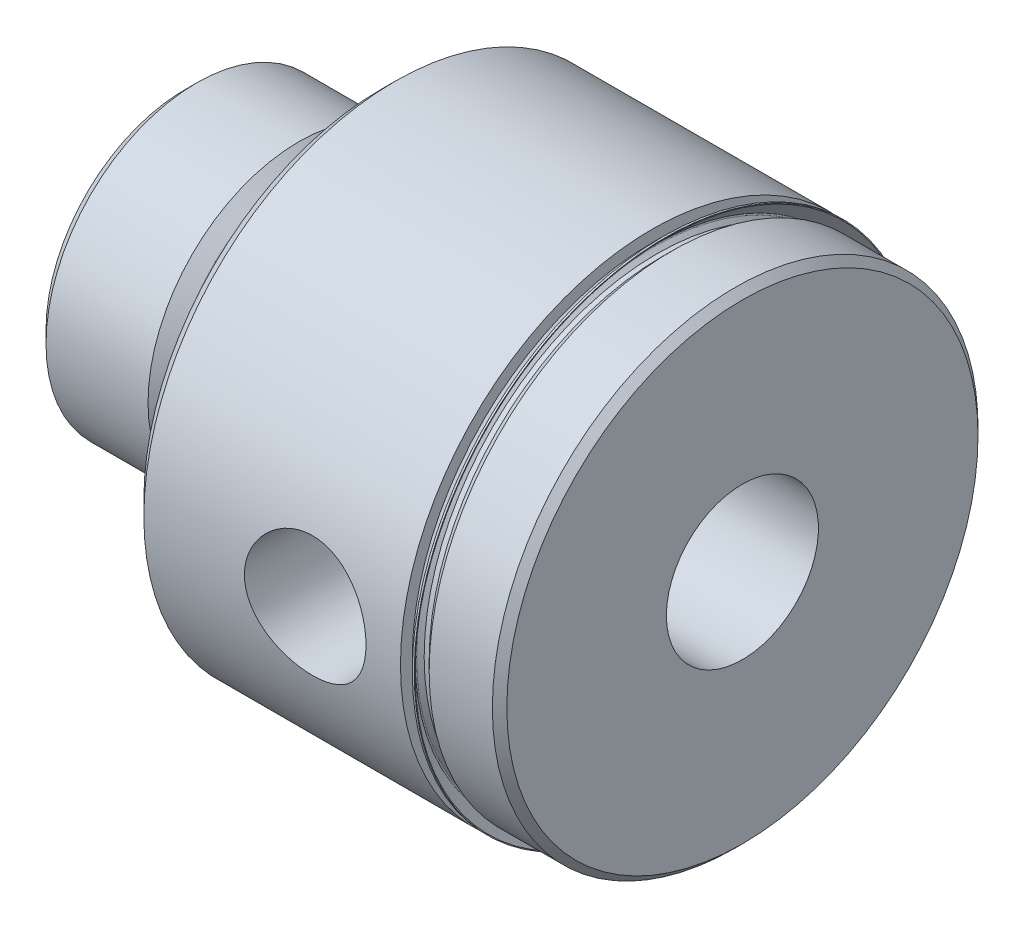
ISO-10303-21;
HEADER;
FILE_DESCRIPTION(('STEP AP214'),'2;1');
FILE_NAME('part.step','',(''),(''),'','','');
FILE_SCHEMA(('AUTOMOTIVE_DESIGN { 1 0 10303 214 1 1 1 1 }'));
ENDSEC;
DATA;
#1=APPLICATION_CONTEXT('core data for automotive mechanical design processes');
#2=APPLICATION_PROTOCOL_DEFINITION('international standard','automotive_design',2000,#1);
#3=PRODUCT_CONTEXT('',#1,'mechanical');
#4=PRODUCT('Part','Part','',(#3));
#5=PRODUCT_RELATED_PRODUCT_CATEGORY('part','',(#4));
#6=PRODUCT_DEFINITION_FORMATION('','',#4);
#7=PRODUCT_DEFINITION_CONTEXT('part definition',#1,'design');
#8=PRODUCT_DEFINITION('design','',#6,#7);
#9=PRODUCT_DEFINITION_SHAPE('','',#8);
#10=(LENGTH_UNIT() NAMED_UNIT(*) SI_UNIT(.MILLI.,.METRE.));
#11=(NAMED_UNIT(*) PLANE_ANGLE_UNIT() SI_UNIT($,.RADIAN.));
#12=(NAMED_UNIT(*) SI_UNIT($,.STERADIAN.) SOLID_ANGLE_UNIT());
#13=UNCERTAINTY_MEASURE_WITH_UNIT(LENGTH_MEASURE(1.E-05),#10,'distance_accuracy_value','');
#14=(GEOMETRIC_REPRESENTATION_CONTEXT(3) GLOBAL_UNCERTAINTY_ASSIGNED_CONTEXT((#13)) GLOBAL_UNIT_ASSIGNED_CONTEXT((#10,
#11,#12)) REPRESENTATION_CONTEXT('',''));
#15=CARTESIAN_POINT('',(0.,0.,0.));
#16=DIRECTION('',(0.,0.,1.));
#17=DIRECTION('',(1.,0.,0.));
#18=AXIS2_PLACEMENT_3D('',#15,#16,#17);
#19=CARTESIAN_POINT('',(58.7248,0.,0.));
#20=DIRECTION('',(-1.,0.,0.));
#21=DIRECTION('',(0.,0.,1.));
#22=AXIS2_PLACEMENT_3D('',#19,#20,#21);
#23=CYLINDRICAL_SURFACE('',#22,24.51735);
#24=CARTESIAN_POINT('',(49.7268500000003,5.32973665201554E-13,0.));
#25=DIRECTION('',(-1.,0.,0.));
#26=DIRECTION('',(0.,-1.,0.));
#27=AXIS2_PLACEMENT_3D('',#24,#25,#26);
#28=CIRCLE('',#27,24.5173499999995);
#29=CARTESIAN_POINT('',(49.7268500000005,-24.5173499999989,0.));
#30=VERTEX_POINT('',#29);
#31=EDGE_CURVE('E194',#30,#30,#28,.T.);
#32=ORIENTED_EDGE('',*,*,#31,.F.);
#33=EDGE_LOOP('',(#32));
#34=FACE_BOUND('',#33,.T.);
#35=CARTESIAN_POINT('',(50.2539,0.,0.));
#36=DIRECTION('',(1.,0.,0.));
#37=DIRECTION('',(0.,0.,-1.));
#38=AXIS2_PLACEMENT_3D('',#35,#36,#37);
#39=CIRCLE('',#38,24.51735);
#40=CARTESIAN_POINT('',(50.2539,0.,-24.51735));
#41=VERTEX_POINT('',#40);
#42=EDGE_CURVE('E204',#41,#41,#39,.T.);
#43=ORIENTED_EDGE('',*,*,#42,.F.);
#44=EDGE_LOOP('',(#43));
#45=FACE_BOUND('',#44,.T.);
#46=ADVANCED_FACE('F15',(#34,#45),#23,.T.);
#47=CARTESIAN_POINT('',(12.0069923389245,0.,0.));
#48=DIRECTION('',(-1.,0.,0.));
#49=DIRECTION('',(0.,0.,1.));
#50=AXIS2_PLACEMENT_3D('',#47,#48,#49);
#51=CONICAL_SURFACE('',#50,15.875,0.768428877685454);
#52=CARTESIAN_POINT('',(12.0069923389245,0.,0.));
#53=DIRECTION('',(-1.,0.,0.));
#54=DIRECTION('',(0.,0.,1.));
#55=AXIS2_PLACEMENT_3D('',#52,#53,#54);
#56=CIRCLE('',#55,15.875);
#57=CARTESIAN_POINT('',(12.0069923389245,0.,15.875));
#58=VERTEX_POINT('',#57);
#59=EDGE_CURVE('E199',#58,#58,#56,.T.);
#60=ORIENTED_EDGE('',*,*,#59,.F.);
#61=EDGE_LOOP('',(#60));
#62=FACE_BOUND('',#61,.T.);
#63=CARTESIAN_POINT('',(13.2834291470904,0.,0.));
#64=DIRECTION('',(1.,0.,0.));
#65=DIRECTION('',(0.,0.,-1.));
#66=AXIS2_PLACEMENT_3D('',#63,#64,#65);
#67=CIRCLE('',#66,14.641164803907);
#68=CARTESIAN_POINT('',(13.2834291470904,0.,-14.641164803907));
#69=VERTEX_POINT('',#68);
#70=EDGE_CURVE('E190',#69,#69,#67,.F.);
#71=ORIENTED_EDGE('',*,*,#70,.T.);
#72=EDGE_LOOP('',(#71));
#73=FACE_BOUND('',#72,.T.);
#74=ADVANCED_FACE('F213',(#62,#73),#51,.T.);
#75=CARTESIAN_POINT('',(51.308,0.,0.));
#76=DIRECTION('',(1.,0.,0.));
#77=DIRECTION('',(0.,1.,0.));
#78=AXIS2_PLACEMENT_3D('',#75,#76,#77);
#79=CONICAL_SURFACE('',#78,25.57145,0.785398163397448);
#80=ORIENTED_EDGE('',*,*,#42,.T.);
#81=EDGE_LOOP('',(#80));
#82=FACE_BOUND('',#81,.T.);
#83=CARTESIAN_POINT('',(51.308,0.,0.));
#84=DIRECTION('',(-1.,0.,0.));
#85=DIRECTION('',(0.,0.,1.));
#86=AXIS2_PLACEMENT_3D('',#83,#84,#85);
#87=CIRCLE('',#86,25.57145);
#88=CARTESIAN_POINT('',(51.308,0.,25.57145));
#89=VERTEX_POINT('',#88);
#90=EDGE_CURVE('E193',#89,#89,#87,.F.);
#91=ORIENTED_EDGE('',*,*,#90,.F.);
#92=EDGE_LOOP('',(#91));
#93=FACE_BOUND('',#92,.T.);
#94=ADVANCED_FACE('F209',(#82,#93),#79,.T.);
#95=CARTESIAN_POINT('',(20.6502,0.,0.));
#96=DIRECTION('',(-1.,0.,0.));
#97=DIRECTION('',(0.,0.,1.));
#98=AXIS2_PLACEMENT_3D('',#95,#96,#97);
#99=CYLINDRICAL_SURFACE('',#98,15.875);
#100=CARTESIAN_POINT('',(1.25984,0.,0.));
#101=DIRECTION('',(1.,0.,0.));
#102=DIRECTION('',(0.,0.,-1.));
#103=AXIS2_PLACEMENT_3D('',#100,#101,#102);
#104=CIRCLE('',#103,15.875);
#105=CARTESIAN_POINT('',(1.25984,0.,-15.875));
#106=VERTEX_POINT('',#105);
#107=EDGE_CURVE('E227',#106,#106,#104,.F.);
#108=ORIENTED_EDGE('',*,*,#107,.F.);
#109=EDGE_LOOP('',(#108));
#110=FACE_BOUND('',#109,.T.);
#111=ORIENTED_EDGE('',*,*,#59,.T.);
#112=EDGE_LOOP('',(#111));
#113=FACE_BOUND('',#112,.T.);
#114=ADVANCED_FACE('F223',(#110,#113),#99,.T.);
#115=CARTESIAN_POINT('',(49.3348163031622,5.27355936696949E-13,0.));
#116=DIRECTION('',(-1.,0.,0.));
#117=DIRECTION('',(0.,-1.,0.));
#118=AXIS2_PLACEMENT_3D('',#115,#116,#117);
#119=CONICAL_SURFACE('',#118,24.9093836968375,0.785398163397439);
#120=ORIENTED_EDGE('',*,*,#31,.T.);
#121=EDGE_LOOP('',(#120));
#122=FACE_BOUND('',#121,.T.);
#123=CARTESIAN_POINT('',(49.3348163031621,5.26394964445129E-13,0.));
#124=DIRECTION('',(1.,0.,0.));
#125=DIRECTION('',(0.,1.,0.));
#126=AXIS2_PLACEMENT_3D('',#123,#124,#125);
#127=CIRCLE('',#126,24.9093836968375);
#128=CARTESIAN_POINT('',(49.3348163031619,24.909383696838,0.));
#129=VERTEX_POINT('',#128);
#130=EDGE_CURVE('E156',#129,#129,#127,.T.);
#131=ORIENTED_EDGE('',*,*,#130,.T.);
#132=EDGE_LOOP('',(#131));
#133=FACE_BOUND('',#132,.T.);
#134=ADVANCED_FACE('F182',(#122,#133),#119,.T.);
#135=CARTESIAN_POINT('',(14.2367,0.,0.));
#136=DIRECTION('',(1.,0.,0.));
#137=DIRECTION('',(0.,0.,-1.));
#138=AXIS2_PLACEMENT_3D('',#135,#136,#137);
#139=TOROIDAL_SURFACE('',#138,15.62735,1.37160000000001);
#140=ORIENTED_EDGE('',*,*,#70,.F.);
#141=EDGE_LOOP('',(#140));
#142=FACE_BOUND('',#141,.T.);
#143=CARTESIAN_POINT('',(14.2367,0.,0.));
#144=DIRECTION('',(-1.,0.,0.));
#145=DIRECTION('',(0.,0.,1.));
#146=AXIS2_PLACEMENT_3D('',#143,#144,#145);
#147=CIRCLE('',#146,14.25575);
#148=CARTESIAN_POINT('',(14.2367,0.,14.25575));
#149=VERTEX_POINT('',#148);
#150=EDGE_CURVE('E151',#149,#149,#147,.F.);
#151=ORIENTED_EDGE('',*,*,#150,.F.);
#152=EDGE_LOOP('',(#151));
#153=FACE_BOUND('',#152,.T.);
#154=ADVANCED_FACE('F177',(#142,#153),#139,.F.);
#155=CARTESIAN_POINT('',(58.7248,0.,0.));
#156=DIRECTION('',(-1.,0.,0.));
#157=DIRECTION('',(0.,0.,1.));
#158=AXIS2_PLACEMENT_3D('',#155,#156,#157);
#159=CYLINDRICAL_SURFACE('',#158,25.57145);
#160=ORIENTED_EDGE('',*,*,#90,.T.);
#161=EDGE_LOOP('',(#160));
#162=FACE_BOUND('',#161,.T.);
#163=CARTESIAN_POINT('',(57.9628,0.,0.));
#164=DIRECTION('',(-1.,0.,0.));
#165=DIRECTION('',(0.,0.,1.));
#166=AXIS2_PLACEMENT_3D('',#163,#164,#165);
#167=CIRCLE('',#166,25.57145);
#168=CARTESIAN_POINT('',(57.9628,0.,25.57145));
#169=VERTEX_POINT('',#168);
#170=EDGE_CURVE('E148',#169,#169,#167,.F.);
#171=ORIENTED_EDGE('',*,*,#170,.F.);
#172=EDGE_LOOP('',(#171));
#173=FACE_BOUND('',#172,.T.);
#174=ADVANCED_FACE('F173',(#162,#173),#159,.T.);
#175=CARTESIAN_POINT('',(1.25984,0.,0.));
#176=DIRECTION('',(1.,0.,0.));
#177=DIRECTION('',(0.,0.,-1.));
#178=AXIS2_PLACEMENT_3D('',#175,#176,#177);
#179=CONICAL_SURFACE('',#178,15.875,0.785398163397449);
#180=CARTESIAN_POINT('',(0.,0.,0.));
#181=DIRECTION('',(1.,0.,0.));
#182=DIRECTION('',(0.,0.,-1.));
#183=AXIS2_PLACEMENT_3D('',#180,#181,#182);
#184=CIRCLE('',#183,14.61516);
#185=CARTESIAN_POINT('',(0.,0.,-14.61516));
#186=VERTEX_POINT('',#185);
#187=EDGE_CURVE('E18',#186,#186,#184,.T.);
#188=ORIENTED_EDGE('',*,*,#187,.T.);
#189=EDGE_LOOP('',(#188));
#190=FACE_BOUND('',#189,.T.);
#191=ORIENTED_EDGE('',*,*,#107,.T.);
#192=EDGE_LOOP('',(#191));
#193=FACE_BOUND('',#192,.T.);
#194=ADVANCED_FACE('F168',(#190,#193),#179,.T.);
#195=CARTESIAN_POINT('',(49.4246188643728,5.27355936696949E-13,0.));
#196=DIRECTION('',(1.,0.,0.));
#197=DIRECTION('',(0.,1.,0.));
#198=AXIS2_PLACEMENT_3D('',#195,#196,#197);
#199=TOROIDAL_SURFACE('',#198,24.9991862580482,0.127000000000001);
#200=CARTESIAN_POINT('',(49.3348163031622,5.28778534245808E-13,0.));
#201=DIRECTION('',(1.,0.,0.));
#202=DIRECTION('',(0.,1.,0.));
#203=AXIS2_PLACEMENT_3D('',#200,#201,#202);
#204=CIRCLE('',#203,25.0889888192589);
#205=CARTESIAN_POINT('',(49.3348163031619,25.0889888192594,0.));
#206=VERTEX_POINT('',#205);
#207=EDGE_CURVE('E137',#206,#206,#204,.T.);
#208=ORIENTED_EDGE('',*,*,#207,.T.);
#209=EDGE_LOOP('',(#208));
#210=FACE_BOUND('',#209,.T.);
#211=ORIENTED_EDGE('',*,*,#130,.F.);
#212=EDGE_LOOP('',(#211));
#213=FACE_BOUND('',#212,.T.);
#214=ADVANCED_FACE('F163',(#210,#213),#199,.F.);
#215=CARTESIAN_POINT('',(20.6502,0.,0.));
#216=DIRECTION('',(-1.,0.,0.));
#217=DIRECTION('',(0.,0.,1.));
#218=AXIS2_PLACEMENT_3D('',#215,#216,#217);
#219=CYLINDRICAL_SURFACE('',#218,14.25575);
#220=ORIENTED_EDGE('',*,*,#150,.T.);
#221=EDGE_LOOP('',(#220));
#222=FACE_BOUND('',#221,.T.);
#223=CARTESIAN_POINT('',(16.1036,0.,0.));
#224=DIRECTION('',(1.,0.,0.));
#225=DIRECTION('',(0.,0.,-1.));
#226=AXIS2_PLACEMENT_3D('',#223,#224,#225);
#227=CIRCLE('',#226,14.25575);
#228=CARTESIAN_POINT('',(16.1036,0.,-14.25575));
#229=VERTEX_POINT('',#228);
#230=EDGE_CURVE('E145',#229,#229,#227,.F.);
#231=ORIENTED_EDGE('',*,*,#230,.T.);
#232=EDGE_LOOP('',(#231));
#233=FACE_BOUND('',#232,.T.);
#234=ADVANCED_FACE('F167',(#222,#233),#219,.T.);
#235=CARTESIAN_POINT('',(57.9628,0.,0.));
#236=DIRECTION('',(-1.,0.,0.));
#237=DIRECTION('',(0.,-1.,0.));
#238=AXIS2_PLACEMENT_3D('',#235,#236,#237);
#239=CONICAL_SURFACE('',#238,25.57145,0.785398163397455);
#240=ORIENTED_EDGE('',*,*,#170,.T.);
#241=EDGE_LOOP('',(#240));
#242=FACE_BOUND('',#241,.T.);
#243=CARTESIAN_POINT('',(58.7248,0.,0.));
#244=DIRECTION('',(-1.,0.,0.));
#245=DIRECTION('',(0.,-1.,0.));
#246=AXIS2_PLACEMENT_3D('',#243,#244,#245);
#247=CIRCLE('',#246,24.80945);
#248=CARTESIAN_POINT('',(58.7248,-24.80945,0.));
#249=VERTEX_POINT('',#248);
#250=EDGE_CURVE('E258',#249,#249,#247,.T.);
#251=ORIENTED_EDGE('',*,*,#250,.T.);
#252=EDGE_LOOP('',(#251));
#253=FACE_BOUND('',#252,.T.);
#254=ADVANCED_FACE('F255',(#242,#253),#239,.T.);
#255=CARTESIAN_POINT('',(0.,0.,0.));
#256=DIRECTION('',(1.,0.,0.));
#257=DIRECTION('',(0.,0.,-1.));
#258=AXIS2_PLACEMENT_3D('',#255,#256,#257);
#259=PLANE('',#258);
#260=CARTESIAN_POINT('',(0.,0.,0.));
#261=DIRECTION('',(-1.,0.,0.));
#262=DIRECTION('',(0.,-1.,0.));
#263=AXIS2_PLACEMENT_3D('',#260,#261,#262);
#264=CIRCLE('',#263,8.76935);
#265=CARTESIAN_POINT('',(0.,-8.76935,0.));
#266=VERTEX_POINT('',#265);
#267=EDGE_CURVE('E260',#266,#266,#264,.F.);
#268=ORIENTED_EDGE('',*,*,#267,.T.);
#269=EDGE_LOOP('',(#268));
#270=FACE_BOUND('',#269,.T.);
#271=ORIENTED_EDGE('',*,*,#187,.F.);
#272=EDGE_LOOP('',(#271));
#273=FACE_BOUND('',#272,.T.);
#274=ADVANCED_FACE('F449',(#270,#273),#259,.F.);
#275=CARTESIAN_POINT('',(50.6475092880286,5.41233724504764E-13,0.));
#276=DIRECTION('',(1.,0.,0.));
#277=DIRECTION('',(0.,1.,0.));
#278=AXIS2_PLACEMENT_3D('',#275,#276,#277);
#279=CONICAL_SURFACE('',#278,26.4016818041253,0.785398163397442);
#280=ORIENTED_EDGE('',*,*,#207,.F.);
#281=EDGE_LOOP('',(#280));
#282=FACE_BOUND('',#281,.T.);
#283=CARTESIAN_POINT('',(50.6475092880286,5.41233724504764E-13,0.));
#284=DIRECTION('',(1.,0.,0.));
#285=DIRECTION('',(0.,1.,0.));
#286=AXIS2_PLACEMENT_3D('',#283,#284,#285);
#287=CIRCLE('',#286,26.4016818041253);
#288=CARTESIAN_POINT('',(50.6475092880283,26.4016818041259,0.));
#289=VERTEX_POINT('',#288);
#290=EDGE_CURVE('E265',#289,#289,#287,.F.);
#291=ORIENTED_EDGE('',*,*,#290,.F.);
#292=EDGE_LOOP('',(#291));
#293=FACE_BOUND('',#292,.T.);
#294=ADVANCED_FACE('F128',(#282,#293),#279,.F.);
#295=CARTESIAN_POINT('',(16.1036,0.,0.));
#296=DIRECTION('',(1.,0.,0.));
#297=DIRECTION('',(0.,0.,-1.));
#298=AXIS2_PLACEMENT_3D('',#295,#296,#297);
#299=TOROIDAL_SURFACE('',#298,15.62735,1.37159999999999);
#300=ORIENTED_EDGE('',*,*,#230,.F.);
#301=EDGE_LOOP('',(#300));
#302=FACE_BOUND('',#301,.T.);
#303=CARTESIAN_POINT('',(17.4752,0.,0.));
#304=DIRECTION('',(-1.,0.,0.));
#305=DIRECTION('',(0.,0.,-1.));
#306=AXIS2_PLACEMENT_3D('',#303,#304,#305);
#307=CIRCLE('',#306,15.62735);
#308=CARTESIAN_POINT('',(17.4752,0.,-15.62735));
#309=VERTEX_POINT('',#308);
#310=EDGE_CURVE('E92',#309,#309,#307,.T.);
#311=ORIENTED_EDGE('',*,*,#310,.T.);
#312=EDGE_LOOP('',(#311));
#313=FACE_BOUND('',#312,.T.);
#314=ADVANCED_FACE('F123',(#302,#313),#299,.F.);
#315=CARTESIAN_POINT('',(58.7248,24.80945,0.));
#316=DIRECTION('',(-1.,0.,0.));
#317=DIRECTION('',(0.,0.,1.));
#318=AXIS2_PLACEMENT_3D('',#315,#316,#317);
#319=PLANE('',#318);
#320=ORIENTED_EDGE('',*,*,#250,.F.);
#321=EDGE_LOOP('',(#320));
#322=FACE_BOUND('',#321,.T.);
#323=CARTESIAN_POINT('',(58.7248,0.,0.));
#324=DIRECTION('',(-1.,0.,0.));
#325=DIRECTION('',(0.,0.,1.));
#326=AXIS2_PLACEMENT_3D('',#323,#324,#325);
#327=CIRCLE('',#326,8.00735);
#328=CARTESIAN_POINT('',(58.7248,0.,8.00735));
#329=VERTEX_POINT('',#328);
#330=EDGE_CURVE('E85',#329,#329,#327,.T.);
#331=ORIENTED_EDGE('',*,*,#330,.T.);
#332=EDGE_LOOP('',(#331));
#333=FACE_BOUND('',#332,.T.);
#334=ADVANCED_FACE('F119',(#322,#333),#319,.F.);
#335=CARTESIAN_POINT('',(0.,0.,0.));
#336=DIRECTION('',(-1.,0.,0.));
#337=DIRECTION('',(0.,-1.,0.));
#338=AXIS2_PLACEMENT_3D('',#335,#336,#337);
#339=CONICAL_SURFACE('',#338,8.76935,0.785398163397453);
#340=ORIENTED_EDGE('',*,*,#267,.F.);
#341=EDGE_LOOP('',(#340));
#342=FACE_BOUND('',#341,.T.);
#343=CARTESIAN_POINT('',(0.761999999999992,0.,0.));
#344=DIRECTION('',(-1.,0.,0.));
#345=DIRECTION('',(0.,0.,1.));
#346=AXIS2_PLACEMENT_3D('',#343,#344,#345);
#347=CIRCLE('',#346,8.00735);
#348=CARTESIAN_POINT('',(0.761999999999992,0.,8.00735));
#349=VERTEX_POINT('',#348);
#350=EDGE_CURVE('E81',#349,#349,#347,.F.);
#351=ORIENTED_EDGE('',*,*,#350,.T.);
#352=EDGE_LOOP('',(#351));
#353=FACE_BOUND('',#352,.T.);
#354=ADVANCED_FACE('F115',(#342,#353),#339,.F.);
#355=CARTESIAN_POINT('',(50.6475092880283,26.4016818041259,0.));
#356=DIRECTION('',(1.,0.,0.));
#357=DIRECTION('',(0.,1.,0.));
#358=AXIS2_PLACEMENT_3D('',#355,#356,#357);
#359=PLANE('',#358);
#360=ORIENTED_EDGE('',*,*,#290,.T.);
#361=EDGE_LOOP('',(#360));
#362=FACE_BOUND('',#361,.T.);
#363=CARTESIAN_POINT('',(50.6475092880285,5.42825589436772E-13,0.));
#364=DIRECTION('',(-1.,0.,0.));
#365=DIRECTION('',(0.,-1.,0.));
#366=AXIS2_PLACEMENT_3D('',#363,#364,#365);
#367=CIRCLE('',#366,26.4858499999995);
#368=CARTESIAN_POINT('',(50.6475092880288,-26.485849999999,0.));
#369=VERTEX_POINT('',#368);
#370=EDGE_CURVE('E84',#369,#369,#367,.T.);
#371=ORIENTED_EDGE('',*,*,#370,.F.);
#372=EDGE_LOOP('',(#371));
#373=FACE_BOUND('',#372,.T.);
#374=ADVANCED_FACE('F110',(#362,#373),#359,.T.);
#375=CARTESIAN_POINT('',(17.4752,15.62735,0.));
#376=DIRECTION('',(1.,0.,0.));
#377=DIRECTION('',(0.,0.,-1.));
#378=AXIS2_PLACEMENT_3D('',#375,#376,#377);
#379=PLANE('',#378);
#380=ORIENTED_EDGE('',*,*,#310,.F.);
#381=EDGE_LOOP('',(#380));
#382=FACE_BOUND('',#381,.T.);
#383=CARTESIAN_POINT('',(17.4752,0.,0.));
#384=DIRECTION('',(-1.,0.,0.));
#385=DIRECTION('',(0.,0.,1.));
#386=AXIS2_PLACEMENT_3D('',#383,#384,#385);
#387=CIRCLE('',#386,17.44345);
#388=CARTESIAN_POINT('',(17.4752,0.,17.44345));
#389=VERTEX_POINT('',#388);
#390=EDGE_CURVE('E274',#389,#389,#387,.F.);
#391=ORIENTED_EDGE('',*,*,#390,.F.);
#392=EDGE_LOOP('',(#391));
#393=FACE_BOUND('',#392,.T.);
#394=ADVANCED_FACE('F99',(#382,#393),#379,.F.);
#395=CARTESIAN_POINT('',(58.7248,0.,0.));
#396=DIRECTION('',(-1.,0.,0.));
#397=DIRECTION('',(0.,0.,1.));
#398=AXIS2_PLACEMENT_3D('',#395,#396,#397);
#399=CYLINDRICAL_SURFACE('',#398,8.00735);
#400=CARTESIAN_POINT('',(42.3378655226703,0.158017197130625,8.00579084592487));
#401=CARTESIAN_POINT('',(42.3292699302208,0.33027309450608,8.00238188699772));
#402=CARTESIAN_POINT('',(42.3065908282713,0.501872250772665,7.99338265716794));
#403=CARTESIAN_POINT('',(42.2340034917107,0.838173081918166,7.96515407303224));
#404=CARTESIAN_POINT('',(42.1840996319257,1.0028758604188,7.94592636238326));
#405=CARTESIAN_POINT('',(42.0591081841969,1.32070664030766,7.89931205695732));
#406=CARTESIAN_POINT('',(41.9840792403693,1.47386058710112,7.87194447781742));
#407=CARTESIAN_POINT('',(41.8111444880152,1.76545512238576,7.8117237745685));
#408=CARTESIAN_POINT('',(41.7132319890959,1.90389139066154,7.77886904700253));
#409=CARTESIAN_POINT('',(41.4921453888799,2.1689875395559,7.70926546452569));
#410=CARTESIAN_POINT('',(41.368031772196,2.29483565116167,7.67240784692046));
#411=CARTESIAN_POINT('',(41.1004324130262,2.52443796381659,7.5999599439646));
#412=CARTESIAN_POINT('',(40.9569409535404,2.62818562125,7.56437003655446));
#413=CARTESIAN_POINT('',(40.6489956382672,2.81372057364353,7.49737900591169));
#414=CARTESIAN_POINT('',(40.4840245201568,2.89471478253851,7.46614478040125));
#415=CARTESIAN_POINT('',(40.1412382677191,3.02734412643813,7.41336577267898));
#416=CARTESIAN_POINT('',(39.9634308705127,3.07899678338204,7.39181520927027));
#417=CARTESIAN_POINT('',(39.6109037003996,3.14861837102262,7.36241906210748));
#418=CARTESIAN_POINT('',(39.4365931875234,3.1683516164685,7.35385739076448));
#419=CARTESIAN_POINT('',(39.0869685160204,3.17880637486327,7.34934639318704));
#420=CARTESIAN_POINT('',(38.9116547124676,3.16953758617001,7.35339285075864));
#421=CARTESIAN_POINT('',(38.5758337062393,3.12384751148693,7.37290769419972));
#422=CARTESIAN_POINT('',(38.4150608137759,3.08904897611976,7.38769295000463));
#423=CARTESIAN_POINT('',(38.1017671556934,2.99550847654387,7.42611063735));
#424=CARTESIAN_POINT('',(37.9492481330063,2.93676147742247,7.44974492922199));
#425=CARTESIAN_POINT('',(37.6505794982407,2.79464532939556,7.50423773574846));
#426=CARTESIAN_POINT('',(37.5048617153085,2.71046021916554,7.53532723543218));
#427=CARTESIAN_POINT('',(37.2289882320523,2.52062949289116,7.60093110350622));
#428=CARTESIAN_POINT('',(37.098838748992,2.41497534825563,7.63544683017211));
#429=CARTESIAN_POINT('',(36.8478253192127,2.17604222647223,7.70708385255809));
#430=CARTESIAN_POINT('',(36.7283475890952,2.04130332636177,7.74421014031998));
#431=CARTESIAN_POINT('',(36.5134395134583,1.75289506289082,7.81453899544264));
#432=CARTESIAN_POINT('',(36.4180108297446,1.59922439242367,7.84774129156873));
#433=CARTESIAN_POINT('',(36.2539038267364,1.2761572011489,7.90671194695377));
#434=CARTESIAN_POINT('',(36.1853159760255,1.10670983926757,7.93245509031458));
#435=CARTESIAN_POINT('',(36.0780631159353,0.757403400856213,7.97338339752746));
#436=CARTESIAN_POINT('',(36.0393822502881,0.577549895961838,7.98857415567311));
#437=CARTESIAN_POINT('',(35.9951065777158,0.224841711111305,8.00601600244233));
#438=CARTESIAN_POINT('',(35.9875678072387,0.0522672410025416,8.00902710451423));
#439=CARTESIAN_POINT('',(36.0005453693607,-0.291635113234431,8.00388390871495));
#440=CARTESIAN_POINT('',(36.0210569746522,-0.462963202522627,7.99573149222237));
#441=CARTESIAN_POINT('',(36.0881289001113,-0.79369871792927,7.96958857661518));
#442=CARTESIAN_POINT('',(36.1338102522844,-0.953312881024318,7.95193048505176));
#443=CARTESIAN_POINT('',(36.2489573913219,-1.26256037149023,7.90872907971695));
#444=CARTESIAN_POINT('',(36.3184272550179,-1.41219198281433,7.88318441443287));
#445=CARTESIAN_POINT('',(36.4823998782694,-1.70405107809093,7.8254018603886));
#446=CARTESIAN_POINT('',(36.5778190576209,-1.84571646487948,7.79293086214361));
#447=CARTESIAN_POINT('',(36.789682949163,-2.1116021653833,7.72513104572469));
#448=CARTESIAN_POINT('',(36.9061367048132,-2.23581493464406,7.68980100197302));
#449=CARTESIAN_POINT('',(37.1652777538997,-2.47124186670984,7.61752693202518));
#450=CARTESIAN_POINT('',(37.3091429161748,-2.58117495670702,7.58061842225449));
#451=CARTESIAN_POINT('',(37.6143180503271,-2.77545194579864,7.51166981773619));
#452=CARTESIAN_POINT('',(37.7756277380891,-2.85979626156669,7.47962964371951));
#453=CARTESIAN_POINT('',(38.110465402269,-2.99957334189352,7.42467858125881));
#454=CARTESIAN_POINT('',(38.2838979819957,-3.05520811031265,7.40170418216341));
#455=CARTESIAN_POINT('',(38.6388090066247,-3.13606647437666,7.36781629171846));
#456=CARTESIAN_POINT('',(38.8202816088084,-3.16131179018365,7.35689418673469));
#457=CARTESIAN_POINT('',(39.1714195231238,-3.17949177126626,7.34905122863639));
#458=CARTESIAN_POINT('',(39.3409479095247,-3.1747108518884,7.35114036555563));
#459=CARTESIAN_POINT('',(39.6765544476149,-3.13835318754059,7.36673443090051));
#460=CARTESIAN_POINT('',(39.8426326179013,-3.1067765870404,7.38023929777787));
#461=CARTESIAN_POINT('',(40.1630879366664,-3.01911317447149,7.41652026333423));
#462=CARTESIAN_POINT('',(40.3176418510403,-2.96357925444967,7.43908647398406));
#463=CARTESIAN_POINT('',(40.6154510015573,-2.82996343720804,7.49093292189928));
#464=CARTESIAN_POINT('',(40.7587028820709,-2.75187487524004,7.52021514317415));
#465=CARTESIAN_POINT('',(41.0400820955451,-2.56931948747171,7.58460337584915));
#466=CARTESIAN_POINT('',(41.1772372952831,-2.46344525437261,7.61996700451888));
#467=CARTESIAN_POINT('',(41.432512896913,-2.23091727308704,7.69125687006834));
#468=CARTESIAN_POINT('',(41.5506271085239,-2.1042567941289,7.72718328576372));
#469=CARTESIAN_POINT('',(41.770751138595,-1.82571169015793,7.79782935810619));
#470=CARTESIAN_POINT('',(41.8715773786177,-1.67284669136421,7.8323844435236));
#471=CARTESIAN_POINT('',(42.0459593825534,-1.3507521967827,7.89429562053241));
#472=CARTESIAN_POINT('',(42.1195131351462,-1.18152149519974,7.92165118112248));
#473=CARTESIAN_POINT('',(42.2090755699737,-0.913702381549876,7.95560641005138));
#474=CARTESIAN_POINT('',(42.2359111597566,-0.819073414191518,7.96593082353915));
#475=CARTESIAN_POINT('',(42.2807327669608,-0.627463075260547,7.98330578194097));
#476=CARTESIAN_POINT('',(42.2987228070423,-0.530482794081207,7.99035781494199));
#477=CARTESIAN_POINT('',(42.3256068110928,-0.335092664136965,8.00093341603618));
#478=CARTESIAN_POINT('',(42.3345022428916,-0.236683048661426,8.00445755351427));
#479=CARTESIAN_POINT('',(42.3430915394779,-0.0394380938665097,8.00786186616747));
#480=CARTESIAN_POINT('',(42.3427866745513,0.0593971847974005,8.00774254439535));
#481=CARTESIAN_POINT('',(42.3378655226703,0.158017197130625,8.00579084592487));
#482=B_SPLINE_CURVE_WITH_KNOTS('',3,(#400,#401,#402,#403,#404,#405,#406,#407,#408,#409,#410,
#411,#412,#413,#414,#415,#416,#417,#418,#419,#420,#421,#422,#423,#424,#425,#426,#427,#428,#429,
#430,#431,#432,#433,#434,#435,#436,#437,#438,#439,#440,#441,#442,#443,#444,#445,#446,#447,#448,
#449,#450,#451,#452,#453,#454,#455,#456,#457,#458,#459,#460,#461,#462,#463,#464,#465,#466,#467,
#468,#469,#470,#471,#472,#473,#474,#475,#476,#477,#478,#479,#480,#481),.UNSPECIFIED.,.T.,.F.,(4,
2,2,2,2,2,2,2,2,2,2,2,2,2,2,2,2,2,2,2,2,2,2,2,2,2,2,2,2,2,2,2,2,2,2,2,2,2,2,2,4),(0.,
0.517139064635379,1.03419505314475,1.55005250394377,2.06606096344135,2.60532168938564,
3.14474186116299,3.70112330537557,4.25717214420193,4.78128270205913,5.30521801467594,
5.79845469532109,6.29179512731562,6.80303382385133,7.31447600880433,7.86352052502776,
8.41260297021161,8.96352050959585,9.51414575947982,10.0298264403398,10.5454202246541,
11.04405542765,11.5427761286376,12.0621212755659,12.5816902399165,13.1334301201408,
13.685161015652,14.2329550371918,14.7803573026503,15.286644488385,15.7929289444738,
16.2881067282521,16.7834309837633,17.311650337448,17.8400410719823,18.3964044393954,
18.9528088299238,19.2491050467085,19.5452663929687,19.8413799325393,20.13745258787),.UNSPECIFIED.);
#483=CARTESIAN_POINT('',(42.3378655226703,0.158017197130625,8.00579084592487));
#484=VERTEX_POINT('',#483);
#485=EDGE_CURVE('E78',#484,#484,#482,.T.);
#486=ORIENTED_EDGE('',*,*,#485,.T.);
#487=EDGE_LOOP('',(#486));
#488=FACE_BOUND('',#487,.T.);
#489=ORIENTED_EDGE('',*,*,#350,.F.);
#490=EDGE_LOOP('',(#489));
#491=FACE_BOUND('',#490,.T.);
#492=ORIENTED_EDGE('',*,*,#330,.F.);
#493=EDGE_LOOP('',(#492));
#494=FACE_BOUND('',#493,.T.);
#495=ADVANCED_FACE('F109',(#488,#491,#494),#399,.F.);
#496=CARTESIAN_POINT('',(50.2539000000003,5.38613598166649E-13,0.));
#497=DIRECTION('',(-1.,0.,0.));
#498=DIRECTION('',(0.,-1.,0.));
#499=AXIS2_PLACEMENT_3D('',#496,#497,#498);
#500=CYLINDRICAL_SURFACE('',#499,26.4858499999995);
#501=ORIENTED_EDGE('',*,*,#370,.T.);
#502=EDGE_LOOP('',(#501));
#503=FACE_BOUND('',#502,.T.);
#504=CARTESIAN_POINT('',(50.4443092880285,5.40651157450229E-13,0.));
#505=DIRECTION('',(1.,0.,0.));
#506=DIRECTION('',(0.,1.,0.));
#507=AXIS2_PLACEMENT_3D('',#504,#505,#506);
#508=CIRCLE('',#507,26.4858499999995);
#509=CARTESIAN_POINT('',(50.4443092880282,26.48585,0.));
#510=VERTEX_POINT('',#509);
#511=EDGE_CURVE('E75',#510,#510,#508,.F.);
#512=ORIENTED_EDGE('',*,*,#511,.F.);
#513=EDGE_LOOP('',(#512));
#514=FACE_BOUND('',#513,.T.);
#515=ADVANCED_FACE('F293',(#503,#514),#500,.T.);
#516=CARTESIAN_POINT('',(20.6502,0.,0.));
#517=DIRECTION('',(-1.,0.,0.));
#518=DIRECTION('',(0.,0.,1.));
#519=AXIS2_PLACEMENT_3D('',#516,#517,#518);
#520=CYLINDRICAL_SURFACE('',#519,17.44345);
#521=ORIENTED_EDGE('',*,*,#390,.T.);
#522=EDGE_LOOP('',(#521));
#523=FACE_BOUND('',#522,.T.);
#524=CARTESIAN_POINT('',(20.6502,0.,0.));
#525=DIRECTION('',(-1.,0.,0.));
#526=DIRECTION('',(0.,0.,1.));
#527=AXIS2_PLACEMENT_3D('',#524,#525,#526);
#528=CIRCLE('',#527,17.44345);
#529=CARTESIAN_POINT('',(20.6502,0.,17.44345));
#530=VERTEX_POINT('',#529);
#531=EDGE_CURVE('E72',#530,#530,#528,.T.);
#532=ORIENTED_EDGE('',*,*,#531,.T.);
#533=EDGE_LOOP('',(#532));
#534=FACE_BOUND('',#533,.T.);
#535=ADVANCED_FACE('F289',(#523,#534),#520,.T.);
#536=CARTESIAN_POINT('',(39.1668,0.,26.48585));
#537=DIRECTION('',(0.,0.,-1.));
#538=DIRECTION('',(-1.,0.,0.));
#539=AXIS2_PLACEMENT_3D('',#536,#537,#538);
#540=CYLINDRICAL_SURFACE('',#539,3.175);
#541=ORIENTED_EDGE('',*,*,#485,.F.);
#542=EDGE_LOOP('',(#541));
#543=FACE_BOUND('',#542,.T.);
#544=CARTESIAN_POINT('',(39.1668,0.,8.9867535450594));
#545=DIRECTION('',(0.,0.,1.));
#546=DIRECTION('',(1.,0.,0.));
#547=AXIS2_PLACEMENT_3D('',#544,#545,#546);
#548=CIRCLE('',#547,3.17499999997423);
#549=CARTESIAN_POINT('',(42.3417999999742,0.,8.9867535450594));
#550=VERTEX_POINT('',#549);
#551=EDGE_CURVE('E69',#550,#550,#548,.T.);
#552=ORIENTED_EDGE('',*,*,#551,.T.);
#553=EDGE_LOOP('',(#552));
#554=FACE_BOUND('',#553,.T.);
#555=ADVANCED_FACE('F283',(#543,#554),#540,.F.);
#556=CARTESIAN_POINT('',(50.4443092880285,5.39499001028787E-13,0.));
#557=DIRECTION('',(1.,0.,0.));
#558=DIRECTION('',(0.,1.,0.));
#559=AXIS2_PLACEMENT_3D('',#556,#557,#558);
#560=CONICAL_SURFACE('',#559,26.4858499999995,0.785398163397442);
#561=ORIENTED_EDGE('',*,*,#511,.T.);
#562=EDGE_LOOP('',(#561));
#563=FACE_BOUND('',#562,.T.);
#564=CARTESIAN_POINT('',(49.1998000000002,5.2596822918834E-13,0.));
#565=DIRECTION('',(1.,0.,0.));
#566=DIRECTION('',(0.,1.,0.));
#567=AXIS2_PLACEMENT_3D('',#564,#565,#566);
#568=CIRCLE('',#567,25.2413407119712);
#569=CARTESIAN_POINT('',(49.1997999999999,25.2413407119717,0.));
#570=VERTEX_POINT('',#569);
#571=EDGE_CURVE('E63',#570,#570,#568,.T.);
#572=ORIENTED_EDGE('',*,*,#571,.T.);
#573=EDGE_LOOP('',(#572));
#574=FACE_BOUND('',#573,.T.);
#575=ADVANCED_FACE('F288',(#563,#574),#560,.T.);
#576=CARTESIAN_POINT('',(20.6502,0.,0.));
#577=DIRECTION('',(1.,0.,0.));
#578=DIRECTION('',(0.,0.,-1.));
#579=AXIS2_PLACEMENT_3D('',#576,#577,#578);
#580=PLANE('',#579);
#581=ORIENTED_EDGE('',*,*,#531,.F.);
#582=EDGE_LOOP('',(#581));
#583=FACE_BOUND('',#582,.T.);
#584=CARTESIAN_POINT('',(20.6502,0.,0.));
#585=DIRECTION('',(1.,0.,0.));
#586=DIRECTION('',(0.,0.,-1.));
#587=AXIS2_PLACEMENT_3D('',#584,#585,#586);
#588=CIRCLE('',#587,24.96185);
#589=CARTESIAN_POINT('',(20.6502,0.,-24.96185));
#590=VERTEX_POINT('',#589);
#591=EDGE_CURVE('E58',#590,#590,#588,.T.);
#592=ORIENTED_EDGE('',*,*,#591,.F.);
#593=EDGE_LOOP('',(#592));
#594=FACE_BOUND('',#593,.T.);
#595=ADVANCED_FACE('F307',(#583,#594),#580,.F.);
#596=CARTESIAN_POINT('',(39.1668,0.,11.7538500000478));
#597=DIRECTION('',(0.,0.,1.));
#598=DIRECTION('',(1.,0.,0.));
#599=AXIS2_PLACEMENT_3D('',#596,#597,#598);
#600=CONICAL_SURFACE('',#599,5.94209645496263,0.785398163397448);
#601=ORIENTED_EDGE('',*,*,#551,.F.);
#602=EDGE_LOOP('',(#601));
#603=FACE_BOUND('',#602,.T.);
#604=CARTESIAN_POINT('',(39.1668,0.,11.753849999991));
#605=DIRECTION('',(0.,0.,1.));
#606=DIRECTION('',(1.,0.,0.));
#607=AXIS2_PLACEMENT_3D('',#604,#605,#606);
#608=CIRCLE('',#607,5.94209645491112);
#609=CARTESIAN_POINT('',(45.1088964549111,0.,11.753849999991));
#610=VERTEX_POINT('',#609);
#611=EDGE_CURVE('E56',#610,#610,#608,.T.);
#612=ORIENTED_EDGE('',*,*,#611,.T.);
#613=EDGE_LOOP('',(#612));
#614=FACE_BOUND('',#613,.T.);
#615=ADVANCED_FACE('F313',(#603,#614),#600,.F.);
#616=CARTESIAN_POINT('',(49.1998,26.48585,0.));
#617=DIRECTION('',(-1.,0.,0.));
#618=DIRECTION('',(0.,0.,1.));
#619=AXIS2_PLACEMENT_3D('',#616,#617,#618);
#620=PLANE('',#619);
#621=CARTESIAN_POINT('',(49.1998,0.,0.));
#622=DIRECTION('',(-1.,0.,0.));
#623=DIRECTION('',(0.,0.,1.));
#624=AXIS2_PLACEMENT_3D('',#621,#622,#623);
#625=CIRCLE('',#624,26.48585);
#626=CARTESIAN_POINT('',(49.1998,0.,26.48585));
#627=VERTEX_POINT('',#626);
#628=EDGE_CURVE('E27',#627,#627,#625,.T.);
#629=ORIENTED_EDGE('',*,*,#628,.F.);
#630=EDGE_LOOP('',(#629));
#631=FACE_BOUND('',#630,.T.);
#632=ORIENTED_EDGE('',*,*,#571,.F.);
#633=EDGE_LOOP('',(#632));
#634=FACE_BOUND('',#633,.T.);
#635=ADVANCED_FACE('F311',(#631,#634),#620,.F.);
#636=CARTESIAN_POINT('',(22.1742,0.,0.));
#637=DIRECTION('',(1.,0.,0.));
#638=DIRECTION('',(0.,0.,-1.));
#639=AXIS2_PLACEMENT_3D('',#636,#637,#638);
#640=CONICAL_SURFACE('',#639,26.48585,0.785398163397447);
#641=ORIENTED_EDGE('',*,*,#591,.T.);
#642=EDGE_LOOP('',(#641));
#643=FACE_BOUND('',#642,.T.);
#644=CARTESIAN_POINT('',(22.1742,0.,0.));
#645=DIRECTION('',(-1.,0.,0.));
#646=DIRECTION('',(0.,0.,1.));
#647=AXIS2_PLACEMENT_3D('',#644,#645,#646);
#648=CIRCLE('',#647,26.48585);
#649=CARTESIAN_POINT('',(22.1742,0.,26.48585));
#650=VERTEX_POINT('',#649);
#651=EDGE_CURVE('E22',#650,#650,#648,.F.);
#652=ORIENTED_EDGE('',*,*,#651,.F.);
#653=EDGE_LOOP('',(#652));
#654=FACE_BOUND('',#653,.T.);
#655=ADVANCED_FACE('F48',(#643,#654),#640,.T.);
#656=CARTESIAN_POINT('',(39.1668,0.,26.5751403861145));
#657=DIRECTION('',(0.,0.,1.));
#658=DIRECTION('',(0.,-1.,0.));
#659=AXIS2_PLACEMENT_3D('',#656,#657,#658);
#660=CONICAL_SURFACE('',#659,6.40481035085677,0.0312094049979596);
#661=ORIENTED_EDGE('',*,*,#611,.F.);
#662=EDGE_LOOP('',(#661));
#663=FACE_BOUND('',#662,.T.);
#664=CARTESIAN_POINT('',(34.5642849775501,-4.43322943993169,26.1121949856265));
#665=CARTESIAN_POINT('',(34.3161772994276,-4.17758902891546,26.1555931680088));
#666=CARTESIAN_POINT('',(34.0893794820739,-3.90104611496595,26.1986667459243));
#667=CARTESIAN_POINT('',(33.6847612370369,-3.31331740879668,26.2794616492879));
#668=CARTESIAN_POINT('',(33.5069642865954,-3.00211511052239,26.3171804049577));
#669=CARTESIAN_POINT('',(33.2056138914852,-2.35311915654086,26.3831276270426));
#670=CARTESIAN_POINT('',(33.0821100535211,-2.01530151372352,26.4113474089132));
#671=CARTESIAN_POINT('',(32.8936823379113,-1.32296211565982,26.4550596651071));
#672=CARTESIAN_POINT('',(32.8287430994852,-0.968444766227467,26.4705554766772));
#673=CARTESIAN_POINT('',(32.7603854225113,-0.260653342539082,26.4868837882417));
#674=CARTESIAN_POINT('',(32.7557155290497,0.0924932323751456,26.4880145613674));
#675=CARTESIAN_POINT('',(32.8048275128278,0.794445448365723,26.4762596304739));
#676=CARTESIAN_POINT('',(32.8586071356243,1.14325125634398,26.4633744670603));
#677=CARTESIAN_POINT('',(33.021874869507,1.82272545615814,26.4252253897571));
#678=CARTESIAN_POINT('',(33.1307419629077,2.15355146953449,26.4000995833721));
#679=CARTESIAN_POINT('',(33.4004514115786,2.79233898675217,26.3401997002648));
#680=CARTESIAN_POINT('',(33.5612995348544,3.10029794851584,26.3054245528768));
#681=CARTESIAN_POINT('',(33.9341734467809,3.69155573751679,26.2290571253479));
#682=CARTESIAN_POINT('',(34.1471836021553,3.97421725114919,26.1873393671619));
#683=CARTESIAN_POINT('',(34.6167317208219,4.50043254922919,26.1020602442251));
#684=CARTESIAN_POINT('',(34.8732767355565,4.74397998582053,26.0584985816723));
#685=CARTESIAN_POINT('',(35.4298423701584,5.19102756625211,25.9731904218575));
#686=CARTESIAN_POINT('',(35.7307556017838,5.39343132085165,25.9315122006265));
#687=CARTESIAN_POINT('',(36.363137116702,5.74497972880217,25.8559071236349));
#688=CARTESIAN_POINT('',(36.6946038766881,5.89412703555384,25.8219798817268));
#689=CARTESIAN_POINT('',(37.3768649582179,6.13390287805675,25.7660758721104));
#690=CARTESIAN_POINT('',(37.7275348255401,6.224868752962,25.7440303331155));
#691=CARTESIAN_POINT('',(38.4397407827274,6.34664431047036,25.7142834767455));
#692=CARTESIAN_POINT('',(38.8012749478827,6.3774645853625,25.706579633654));
#693=CARTESIAN_POINT('',(39.5157496900696,6.3779125328466,25.706466934303));
#694=CARTESIAN_POINT('',(39.8686901915805,6.34897785138554,25.713698741093));
#695=CARTESIAN_POINT('',(40.5645026907595,6.23376530921724,25.7418702038075));
#696=CARTESIAN_POINT('',(40.907374607737,6.14748698908335,25.7628099695576));
#697=CARTESIAN_POINT('',(41.5730777532422,5.92046426048327,25.8159216343983));
#698=CARTESIAN_POINT('',(41.8959361644766,5.77979569394164,25.8480778871015));
#699=CARTESIAN_POINT('',(42.5137003028111,5.44805051404046,25.9200249414213));
#700=CARTESIAN_POINT('',(42.8086019267007,5.25696651674268,25.9598168611389));
#701=CARTESIAN_POINT('',(43.3694238154152,4.82447719776568,26.0436975707497));
#702=CARTESIAN_POINT('',(43.6345083612249,4.5820027834817,26.0878648953292));
#703=CARTESIAN_POINT('',(44.1204940781437,4.05595972100532,26.1748044267227));
#704=CARTESIAN_POINT('',(44.3413917986094,3.77238786640603,26.2175765243623));
#705=CARTESIAN_POINT('',(44.7346563832374,3.16868284969151,26.2973979469732));
#706=CARTESIAN_POINT('',(44.9065417676544,2.84822765159605,26.3343889833743));
#707=CARTESIAN_POINT('',(45.1935527619267,2.18186948925374,26.3979457244103));
#708=CARTESIAN_POINT('',(45.308687619376,1.8359706816501,26.4245131274498));
#709=CARTESIAN_POINT('',(45.4764476834789,1.13660188560917,26.463716895981));
#710=CARTESIAN_POINT('',(45.5303869524577,0.783463729411978,26.4766456804754));
#711=CARTESIAN_POINT('',(45.578369889763,0.0729320923672737,26.4881311727373));
#712=CARTESIAN_POINT('',(45.572422368211,-0.284460754833635,26.4866899945124));
#713=CARTESIAN_POINT('',(45.5016682302251,-0.98494081975903,26.4697985421046));
#714=CARTESIAN_POINT('',(45.4381743528975,-1.32816940107757,26.4546607265897));
#715=CARTESIAN_POINT('',(45.2562589215874,-1.99895770885352,26.4124483877331));
#716=CARTESIAN_POINT('',(45.1378347108388,-2.32651667658735,26.3853732870344));
#717=CARTESIAN_POINT('',(44.848419756339,-2.96005821815904,26.3218666004546));
#718=CARTESIAN_POINT('',(44.6769711334384,-3.26582313254338,26.2853539889435));
#719=CARTESIAN_POINT('',(44.2867815525065,-3.84475943022554,26.2069370315123));
#720=CARTESIAN_POINT('',(44.0680325550224,-4.11792526052547,26.165031769516));
#721=CARTESIAN_POINT('',(43.5824018240727,-4.63187808819323,26.0790300781009));
#722=CARTESIAN_POINT('',(43.3143586864041,-4.87156390235356,26.0349050927812));
#723=CARTESIAN_POINT('',(42.7415654893289,-5.30299746730376,25.9504707535149));
#724=CARTESIAN_POINT('',(42.4368131248059,-5.49474220535767,25.9101616394658));
#725=CARTESIAN_POINT('',(41.7960844095953,-5.8262503738795,25.837651184504));
#726=CARTESIAN_POINT('',(41.4598727722389,-5.96557520791734,25.8055189513089));
#727=CARTESIAN_POINT('',(40.7678977374383,-6.18562606239541,25.7536636307325));
#728=CARTESIAN_POINT('',(40.4121380216783,-6.26636307684574,25.7339382153032));
#729=CARTESIAN_POINT('',(39.6992414235301,-6.36548912681337,25.7095969545698));
#730=CARTESIAN_POINT('',(39.3422939842948,-6.385164921635,25.7046693444809));
#731=CARTESIAN_POINT('',(38.6301533309349,-6.36514555718595,25.7096339531778));
#732=CARTESIAN_POINT('',(38.2749601557553,-6.32544908573109,25.7195264995034));
#733=CARTESIAN_POINT('',(37.5816021366711,-6.18899410163925,25.7526962654412));
#734=CARTESIAN_POINT('',(37.2432685549778,-6.09304190155183,25.7757842397214));
#735=CARTESIAN_POINT('',(36.5876525599264,-5.84769919918564,25.8325455427564));
#736=CARTESIAN_POINT('',(36.2703620548371,-5.69832938057692,25.8662147737647));
#737=CARTESIAN_POINT('',(35.7096413908069,-5.37612359118084,25.9349263678805));
#738=CARTESIAN_POINT('',(35.4622151854272,-5.20998248370096,25.9690363762369));
#739=CARTESIAN_POINT('',(34.9930112327621,-4.84515293906188,26.0395711089503));
#740=CARTESIAN_POINT('',(34.7712349840308,-4.64646260190755,26.0759959683561));
#741=CARTESIAN_POINT('',(34.5642849775501,-4.43322943993169,26.1121949856265));
#742=B_SPLINE_CURVE_WITH_KNOTS('',3,(#664,#665,#666,#667,#668,#669,#670,#671,#672,#673,#674,
#675,#676,#677,#678,#679,#680,#681,#682,#683,#684,#685,#686,#687,#688,#689,#690,#691,#692,#693,
#694,#695,#696,#697,#698,#699,#700,#701,#702,#703,#704,#705,#706,#707,#708,#709,#710,#711,#712,
#713,#714,#715,#716,#717,#718,#719,#720,#721,#722,#723,#724,#725,#726,#727,#728,#729,#730,#731,
#732,#733,#734,#735,#736,#737,#738,#739,#740,#741),.UNSPECIFIED.,.T.,.F.,(4,2,2,2,2,2,2,2,2,2,2,
2,2,2,2,2,2,2,2,2,2,2,2,2,2,2,2,2,2,2,2,2,2,2,2,2,2,2,4),(0.,1.07558643103326,2.15168730350609,
3.22876935803585,4.30556882484216,5.35997237143655,6.41433525031008,7.45706831793135,
8.49991713078657,9.56421034621491,10.6286761125171,11.7185855392841,12.8084406558185,
13.8919180363775,14.9752045876553,16.0327321378049,17.090268160772,18.1463348395744,
19.2025562778217,20.2833964318026,21.3643209579689,22.4555245288626,23.5465502274605,
24.6136763726607,25.6806455320986,26.7238713820973,27.7671476941278,28.8196971196253,
29.872425583498,30.9541969435826,32.0360362677816,33.126736013678,34.2172310366967,
35.2845840871894,36.3519607275599,37.4044002697903,38.45643274062,39.353541702711,
40.2507030503862),.UNSPECIFIED.);
#743=CARTESIAN_POINT('',(34.5642849775501,-4.43322943993169,26.1121949856265));
#744=VERTEX_POINT('',#743);
#745=EDGE_CURVE('E10',#744,#744,#742,.T.);
#746=ORIENTED_EDGE('',*,*,#745,.F.);
#747=EDGE_LOOP('',(#746));
#748=FACE_BOUND('',#747,.T.);
#749=ADVANCED_FACE('F38',(#663,#748),#660,.F.);
#750=CARTESIAN_POINT('',(58.7248,0.,0.));
#751=DIRECTION('',(-1.,0.,0.));
#752=DIRECTION('',(0.,0.,1.));
#753=AXIS2_PLACEMENT_3D('',#750,#751,#752);
#754=CYLINDRICAL_SURFACE('',#753,26.48585);
#755=ORIENTED_EDGE('',*,*,#745,.T.);
#756=EDGE_LOOP('',(#755));
#757=FACE_BOUND('',#756,.T.);
#758=ORIENTED_EDGE('',*,*,#651,.T.);
#759=EDGE_LOOP('',(#758));
#760=FACE_BOUND('',#759,.T.);
#761=ORIENTED_EDGE('',*,*,#628,.T.);
#762=EDGE_LOOP('',(#761));
#763=FACE_BOUND('',#762,.T.);
#764=ADVANCED_FACE('F41',(#757,#760,#763),#754,.T.);
#765=CLOSED_SHELL('',(#46,#74,#94,#114,#134,#154,#174,#194,#214,#234,#254,#274,#294,#314,#334,
#354,#374,#394,#495,#515,#535,#555,#575,#595,#615,#635,#655,#749,#764));
#766=MANIFOLD_SOLID_BREP('B1',#765);
#767=ADVANCED_BREP_SHAPE_REPRESENTATION('',(#18,#766),#14);
#768=SHAPE_DEFINITION_REPRESENTATION(#9,#767);
ENDSEC;
END-ISO-10303-21;
